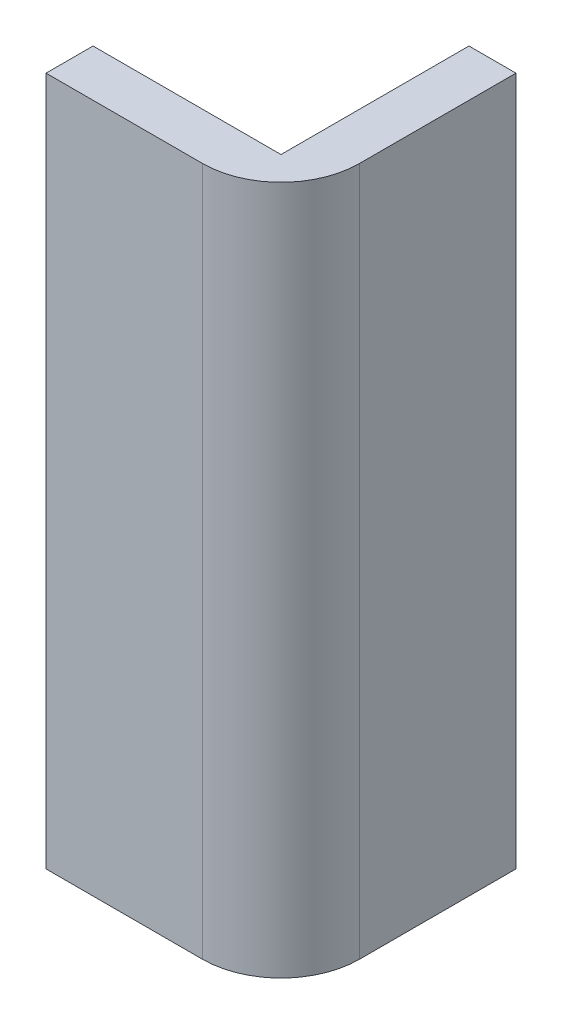
ISO-10303-21;
HEADER;
FILE_DESCRIPTION(('STEP AP214'),'2;1');
FILE_NAME('part.step','',(''),(''),'','','');
FILE_SCHEMA(('AUTOMOTIVE_DESIGN { 1 0 10303 214 1 1 1 1 }'));
ENDSEC;
DATA;
#1=APPLICATION_CONTEXT('core data for automotive mechanical design processes');
#2=APPLICATION_PROTOCOL_DEFINITION('international standard','automotive_design',2000,#1);
#3=PRODUCT_CONTEXT('',#1,'mechanical');
#4=PRODUCT('Part','Part','',(#3));
#5=PRODUCT_RELATED_PRODUCT_CATEGORY('part','',(#4));
#6=PRODUCT_DEFINITION_FORMATION('','',#4);
#7=PRODUCT_DEFINITION_CONTEXT('part definition',#1,'design');
#8=PRODUCT_DEFINITION('design','',#6,#7);
#9=PRODUCT_DEFINITION_SHAPE('','',#8);
#10=(LENGTH_UNIT() NAMED_UNIT(*) SI_UNIT(.MILLI.,.METRE.));
#11=(NAMED_UNIT(*) PLANE_ANGLE_UNIT() SI_UNIT($,.RADIAN.));
#12=(NAMED_UNIT(*) SI_UNIT($,.STERADIAN.) SOLID_ANGLE_UNIT());
#13=UNCERTAINTY_MEASURE_WITH_UNIT(LENGTH_MEASURE(1.E-05),#10,'distance_accuracy_value','');
#14=(GEOMETRIC_REPRESENTATION_CONTEXT(3) GLOBAL_UNCERTAINTY_ASSIGNED_CONTEXT((#13)) GLOBAL_UNIT_ASSIGNED_CONTEXT((#10,
#11,#12)) REPRESENTATION_CONTEXT('',''));
#15=CARTESIAN_POINT('',(0.,0.,0.));
#16=DIRECTION('',(0.,0.,1.));
#17=DIRECTION('',(1.,0.,0.));
#18=AXIS2_PLACEMENT_3D('',#15,#16,#17);
#19=CARTESIAN_POINT('',(52.6371308016878,-0.0100000000000031,22.1518987341772));
#20=DIRECTION('',(1.,0.,0.));
#21=DIRECTION('',(0.,0.,-1.));
#22=AXIS2_PLACEMENT_3D('',#19,#20,#21);
#23=PLANE('',#22);
#24=DIRECTION('',(0.,0.,1.));
#25=VECTOR('',#24,1.);
#26=CARTESIAN_POINT('',(52.6371308016879,3.,2.43495644026E-13));
#27=LINE('',#26,#25);
#28=CARTESIAN_POINT('',(52.6371308016878,3.,19.1518987341772));
#29=VERTEX_POINT('',#28);
#30=CARTESIAN_POINT('',(52.6371308016877,3.,22.1518987341772));
#31=VERTEX_POINT('',#30);
#32=EDGE_CURVE('E106',#29,#31,#27,.T.);
#33=ORIENTED_EDGE('',*,*,#32,.T.);
#34=DIRECTION('',(0.,-1.,0.));
#35=VECTOR('',#34,1.);
#36=CARTESIAN_POINT('',(52.6371308016877,50.,22.1518987341772));
#37=LINE('',#36,#35);
#38=CARTESIAN_POINT('',(52.6371308016877,47.,22.1518987341772));
#39=VERTEX_POINT('',#38);
#40=EDGE_CURVE('E140',#39,#31,#37,.T.);
#41=ORIENTED_EDGE('',*,*,#40,.F.);
#42=DIRECTION('',(0.,0.,-1.));
#43=VECTOR('',#42,1.);
#44=CARTESIAN_POINT('',(52.6371308016879,47.,2.43495644026E-13));
#45=LINE('',#44,#43);
#46=CARTESIAN_POINT('',(52.6371308016878,47.,19.1518987341772));
#47=VERTEX_POINT('',#46);
#48=EDGE_CURVE('E144',#39,#47,#45,.T.);
#49=ORIENTED_EDGE('',*,*,#48,.T.);
#50=DIRECTION('',(0.,1.,0.));
#51=VECTOR('',#50,1.);
#52=CARTESIAN_POINT('',(52.6371308016878,-0.0100000000000031,19.1518987341772));
#53=LINE('',#52,#51);
#54=EDGE_CURVE('E142',#29,#47,#53,.T.);
#55=ORIENTED_EDGE('',*,*,#54,.F.);
#56=EDGE_LOOP('',(#33,#41,#49,#55));
#57=FACE_BOUND('',#56,.T.);
#58=ADVANCED_FACE('F32',(#57),#23,.F.);
#59=CARTESIAN_POINT('',(64.6371308016878,-0.0100000000000031,7.15189873417722));
#60=DIRECTION('',(0.,0.,1.));
#61=DIRECTION('',(1.,0.,0.));
#62=AXIS2_PLACEMENT_3D('',#59,#60,#61);
#63=PLANE('',#62);
#64=DIRECTION('',(-1.,0.,0.));
#65=VECTOR('',#64,1.);
#66=CARTESIAN_POINT('',(0.,3.,7.15189873417722));
#67=LINE('',#66,#65);
#68=CARTESIAN_POINT('',(67.6371308016878,3.,7.15189873417722));
#69=VERTEX_POINT('',#68);
#70=CARTESIAN_POINT('',(64.6371308016878,3.,7.15189873417722));
#71=VERTEX_POINT('',#70);
#72=EDGE_CURVE('E102',#69,#71,#67,.T.);
#73=ORIENTED_EDGE('',*,*,#72,.T.);
#74=DIRECTION('',(0.,1.,0.));
#75=VECTOR('',#74,1.);
#76=CARTESIAN_POINT('',(64.6371308016878,47.,7.15189873417722));
#77=LINE('',#76,#75);
#78=CARTESIAN_POINT('',(64.6371308016878,47.,7.15189873417722));
#79=VERTEX_POINT('',#78);
#80=EDGE_CURVE('E94',#71,#79,#77,.T.);
#81=ORIENTED_EDGE('',*,*,#80,.T.);
#82=DIRECTION('',(1.,0.,0.));
#83=VECTOR('',#82,1.);
#84=CARTESIAN_POINT('',(0.,47.,7.15189873417722));
#85=LINE('',#84,#83);
#86=CARTESIAN_POINT('',(67.6371308016878,47.,7.15189873417722));
#87=VERTEX_POINT('',#86);
#88=EDGE_CURVE('E147',#79,#87,#85,.T.);
#89=ORIENTED_EDGE('',*,*,#88,.T.);
#90=DIRECTION('',(0.,1.,0.));
#91=VECTOR('',#90,1.);
#92=CARTESIAN_POINT('',(67.6371308016878,-0.0100000000000031,7.15189873417722));
#93=LINE('',#92,#91);
#94=EDGE_CURVE('E105',#69,#87,#93,.T.);
#95=ORIENTED_EDGE('',*,*,#94,.F.);
#96=EDGE_LOOP('',(#73,#81,#89,#95));
#97=FACE_BOUND('',#96,.T.);
#98=ADVANCED_FACE('F104',(#97),#63,.F.);
#99=CARTESIAN_POINT('',(-98.3544303797468,47.,19.1518987341772));
#100=DIRECTION('',(0.,0.,-1.));
#101=DIRECTION('',(-1.,0.,0.));
#102=AXIS2_PLACEMENT_3D('',#99,#100,#101);
#103=PLANE('',#102);
#104=DIRECTION('',(1.,0.,0.));
#105=VECTOR('',#104,1.);
#106=CARTESIAN_POINT('',(-98.3544303797468,3.,19.1518987341772));
#107=LINE('',#106,#105);
#108=CARTESIAN_POINT('',(64.6371308016878,3.,19.1518987341772));
#109=VERTEX_POINT('',#108);
#110=EDGE_CURVE('E11',#29,#109,#107,.T.);
#111=ORIENTED_EDGE('',*,*,#110,.F.);
#112=ORIENTED_EDGE('',*,*,#54,.T.);
#113=DIRECTION('',(1.,0.,0.));
#114=VECTOR('',#113,1.);
#115=CARTESIAN_POINT('',(-98.3544303797468,47.,19.1518987341772));
#116=LINE('',#115,#114);
#117=CARTESIAN_POINT('',(64.6371308016878,47.,19.1518987341772));
#118=VERTEX_POINT('',#117);
#119=EDGE_CURVE('E36',#47,#118,#116,.T.);
#120=ORIENTED_EDGE('',*,*,#119,.T.);
#121=DIRECTION('',(0.,-1.,0.));
#122=VECTOR('',#121,1.);
#123=CARTESIAN_POINT('',(64.6371308016878,47.,19.1518987341772));
#124=LINE('',#123,#122);
#125=EDGE_CURVE('E118',#118,#109,#124,.T.);
#126=ORIENTED_EDGE('',*,*,#125,.T.);
#127=EDGE_LOOP('',(#111,#112,#120,#126));
#128=FACE_BOUND('',#127,.T.);
#129=ADVANCED_FACE('F34',(#128),#103,.T.);
#130=CARTESIAN_POINT('',(62.6371308016878,50.,17.1518987341772));
#131=DIRECTION('',(0.,-1.,0.));
#132=DIRECTION('',(0.,0.,-1.));
#133=AXIS2_PLACEMENT_3D('',#130,#131,#132);
#134=CYLINDRICAL_SURFACE('',#133,5.);
#135=DIRECTION('',(0.,-1.,0.));
#136=VECTOR('',#135,1.);
#137=CARTESIAN_POINT('',(67.6371308016878,50.,17.1518987341772));
#138=LINE('',#137,#136);
#139=CARTESIAN_POINT('',(67.6371308016878,47.,17.1518987341772));
#140=VERTEX_POINT('',#139);
#141=CARTESIAN_POINT('',(67.6371308016878,3.,17.1518987341772));
#142=VERTEX_POINT('',#141);
#143=EDGE_CURVE('E136',#140,#142,#138,.T.);
#144=ORIENTED_EDGE('',*,*,#143,.F.);
#145=CARTESIAN_POINT('',(62.6371308016878,47.,17.1518987341772));
#146=DIRECTION('',(0.,1.,0.));
#147=DIRECTION('',(0.,0.,1.));
#148=AXIS2_PLACEMENT_3D('',#145,#146,#147);
#149=CIRCLE('',#148,5.);
#150=CARTESIAN_POINT('',(62.6371308016878,47.,22.1518987341772));
#151=VERTEX_POINT('',#150);
#152=EDGE_CURVE('E120',#140,#151,#149,.F.);
#153=ORIENTED_EDGE('',*,*,#152,.T.);
#154=DIRECTION('',(0.,-1.,0.));
#155=VECTOR('',#154,1.);
#156=CARTESIAN_POINT('',(62.6371308016878,50.,22.1518987341772));
#157=LINE('',#156,#155);
#158=CARTESIAN_POINT('',(62.6371308016878,3.,22.1518987341772));
#159=VERTEX_POINT('',#158);
#160=EDGE_CURVE('E132',#159,#151,#157,.F.);
#161=ORIENTED_EDGE('',*,*,#160,.F.);
#162=CARTESIAN_POINT('',(62.6371308016878,3.,17.1518987341772));
#163=DIRECTION('',(0.,-1.,0.));
#164=DIRECTION('',(0.,0.,-1.));
#165=AXIS2_PLACEMENT_3D('',#162,#163,#164);
#166=CIRCLE('',#165,5.);
#167=EDGE_CURVE('E126',#159,#142,#166,.F.);
#168=ORIENTED_EDGE('',*,*,#167,.T.);
#169=EDGE_LOOP('',(#144,#153,#161,#168));
#170=FACE_BOUND('',#169,.T.);
#171=ADVANCED_FACE('F153',(#170),#134,.T.);
#172=CARTESIAN_POINT('',(0.,47.,0.));
#173=DIRECTION('',(0.,1.,0.));
#174=DIRECTION('',(0.,0.,1.));
#175=AXIS2_PLACEMENT_3D('',#172,#173,#174);
#176=PLANE('',#175);
#177=ORIENTED_EDGE('',*,*,#48,.F.);
#178=DIRECTION('',(1.,0.,0.));
#179=VECTOR('',#178,1.);
#180=CARTESIAN_POINT('',(-98.3544303797468,47.,22.1518987341772));
#181=LINE('',#180,#179);
#182=EDGE_CURVE('E119',#39,#151,#181,.T.);
#183=ORIENTED_EDGE('',*,*,#182,.T.);
#184=ORIENTED_EDGE('',*,*,#152,.F.);
#185=DIRECTION('',(0.,0.,-1.));
#186=VECTOR('',#185,1.);
#187=CARTESIAN_POINT('',(67.6371308016878,47.,-47.8481012658228));
#188=LINE('',#187,#186);
#189=EDGE_CURVE('E110',#140,#87,#188,.T.);
#190=ORIENTED_EDGE('',*,*,#189,.T.);
#191=ORIENTED_EDGE('',*,*,#88,.F.);
#192=DIRECTION('',(0.,0.,-1.));
#193=VECTOR('',#192,1.);
#194=CARTESIAN_POINT('',(64.6371308016878,47.,-47.8481012658228));
#195=LINE('',#194,#193);
#196=EDGE_CURVE('E99',#118,#79,#195,.T.);
#197=ORIENTED_EDGE('',*,*,#196,.F.);
#198=ORIENTED_EDGE('',*,*,#119,.F.);
#199=EDGE_LOOP('',(#177,#183,#184,#190,#191,#197,#198));
#200=FACE_BOUND('',#199,.T.);
#201=ADVANCED_FACE('F150',(#200),#176,.T.);
#202=CARTESIAN_POINT('',(0.,3.,0.));
#203=DIRECTION('',(0.,-1.,0.));
#204=DIRECTION('',(0.,0.,-1.));
#205=AXIS2_PLACEMENT_3D('',#202,#203,#204);
#206=PLANE('',#205);
#207=ORIENTED_EDGE('',*,*,#32,.F.);
#208=ORIENTED_EDGE('',*,*,#110,.T.);
#209=DIRECTION('',(0.,0.,-1.));
#210=VECTOR('',#209,1.);
#211=CARTESIAN_POINT('',(64.6371308016878,3.,-47.8481012658228));
#212=LINE('',#211,#210);
#213=EDGE_CURVE('E41',#109,#71,#212,.T.);
#214=ORIENTED_EDGE('',*,*,#213,.T.);
#215=ORIENTED_EDGE('',*,*,#72,.F.);
#216=DIRECTION('',(0.,0.,1.));
#217=VECTOR('',#216,1.);
#218=CARTESIAN_POINT('',(67.6371308016878,3.,-47.8481012658228));
#219=LINE('',#218,#217);
#220=EDGE_CURVE('E54',#69,#142,#219,.T.);
#221=ORIENTED_EDGE('',*,*,#220,.T.);
#222=ORIENTED_EDGE('',*,*,#167,.F.);
#223=DIRECTION('',(-1.,0.,0.));
#224=VECTOR('',#223,1.);
#225=CARTESIAN_POINT('',(-98.3544303797468,3.,22.1518987341772));
#226=LINE('',#225,#224);
#227=EDGE_CURVE('E117',#159,#31,#226,.T.);
#228=ORIENTED_EDGE('',*,*,#227,.T.);
#229=EDGE_LOOP('',(#207,#208,#214,#215,#221,#222,#228));
#230=FACE_BOUND('',#229,.T.);
#231=ADVANCED_FACE('F108',(#230),#206,.T.);
#232=CARTESIAN_POINT('',(67.6371308016878,50.,-47.8481012658228));
#233=DIRECTION('',(-1.,0.,0.));
#234=DIRECTION('',(0.,0.,1.));
#235=AXIS2_PLACEMENT_3D('',#232,#233,#234);
#236=PLANE('',#235);
#237=ORIENTED_EDGE('',*,*,#220,.F.);
#238=ORIENTED_EDGE('',*,*,#94,.T.);
#239=ORIENTED_EDGE('',*,*,#189,.F.);
#240=ORIENTED_EDGE('',*,*,#143,.T.);
#241=EDGE_LOOP('',(#237,#238,#239,#240));
#242=FACE_BOUND('',#241,.T.);
#243=ADVANCED_FACE('F152',(#242),#236,.F.);
#244=CARTESIAN_POINT('',(-98.3544303797468,50.,22.1518987341772));
#245=DIRECTION('',(0.,0.,-1.));
#246=DIRECTION('',(-1.,0.,0.));
#247=AXIS2_PLACEMENT_3D('',#244,#245,#246);
#248=PLANE('',#247);
#249=ORIENTED_EDGE('',*,*,#182,.F.);
#250=ORIENTED_EDGE('',*,*,#40,.T.);
#251=ORIENTED_EDGE('',*,*,#227,.F.);
#252=ORIENTED_EDGE('',*,*,#160,.T.);
#253=EDGE_LOOP('',(#249,#250,#251,#252));
#254=FACE_BOUND('',#253,.T.);
#255=ADVANCED_FACE('F156',(#254),#248,.F.);
#256=CARTESIAN_POINT('',(64.6371308016878,47.,-47.8481012658228));
#257=DIRECTION('',(-1.,0.,0.));
#258=DIRECTION('',(0.,0.,1.));
#259=AXIS2_PLACEMENT_3D('',#256,#257,#258);
#260=PLANE('',#259);
#261=ORIENTED_EDGE('',*,*,#80,.F.);
#262=ORIENTED_EDGE('',*,*,#213,.F.);
#263=ORIENTED_EDGE('',*,*,#125,.F.);
#264=ORIENTED_EDGE('',*,*,#196,.T.);
#265=EDGE_LOOP('',(#261,#262,#263,#264));
#266=FACE_BOUND('',#265,.T.);
#267=ADVANCED_FACE('F96',(#266),#260,.T.);
#268=CLOSED_SHELL('',(#58,#98,#129,#171,#201,#231,#243,#255,#267));
#269=MANIFOLD_SOLID_BREP('B2',#268);
#270=ADVANCED_BREP_SHAPE_REPRESENTATION('',(#18,#269),#14);
#271=SHAPE_DEFINITION_REPRESENTATION(#9,#270);
ENDSEC;
END-ISO-10303-21;
